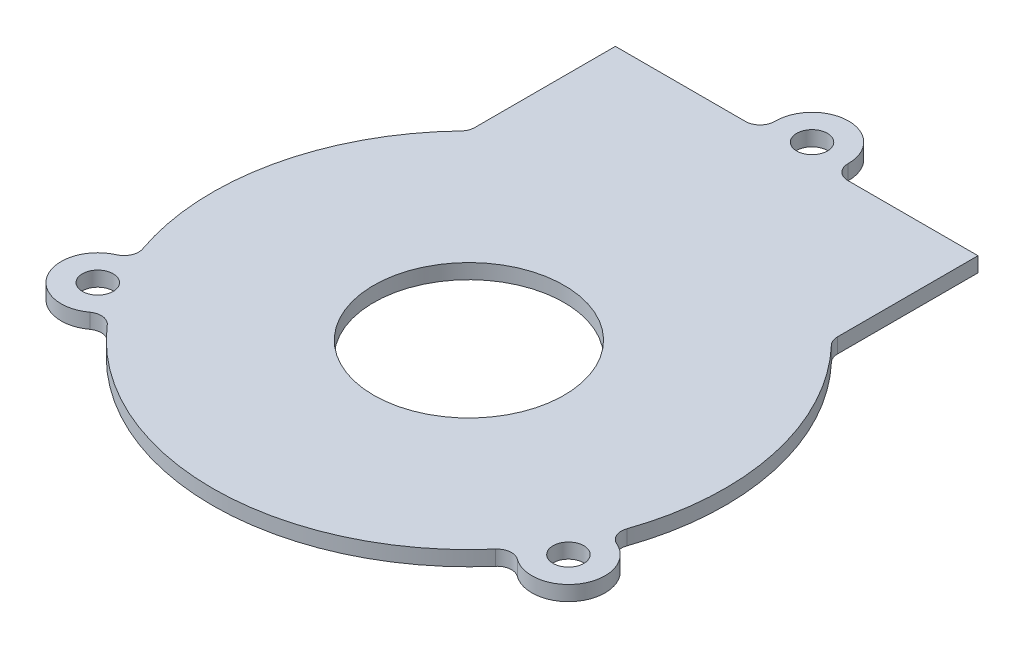
ISO-10303-21;
HEADER;
FILE_DESCRIPTION(('STEP AP214'),'2;1');
FILE_NAME('part.step','',(''),(''),'','','');
FILE_SCHEMA(('AUTOMOTIVE_DESIGN { 1 0 10303 214 1 1 1 1 }'));
ENDSEC;
DATA;
#1=APPLICATION_CONTEXT('core data for automotive mechanical design processes');
#2=APPLICATION_PROTOCOL_DEFINITION('international standard','automotive_design',2000,#1);
#3=PRODUCT_CONTEXT('',#1,'mechanical');
#4=PRODUCT('Part','Part','',(#3));
#5=PRODUCT_RELATED_PRODUCT_CATEGORY('part','',(#4));
#6=PRODUCT_DEFINITION_FORMATION('','',#4);
#7=PRODUCT_DEFINITION_CONTEXT('part definition',#1,'design');
#8=PRODUCT_DEFINITION('design','',#6,#7);
#9=PRODUCT_DEFINITION_SHAPE('','',#8);
#10=(LENGTH_UNIT() NAMED_UNIT(*) SI_UNIT(.MILLI.,.METRE.));
#11=(NAMED_UNIT(*) PLANE_ANGLE_UNIT() SI_UNIT($,.RADIAN.));
#12=(NAMED_UNIT(*) SI_UNIT($,.STERADIAN.) SOLID_ANGLE_UNIT());
#13=UNCERTAINTY_MEASURE_WITH_UNIT(LENGTH_MEASURE(1.E-05),#10,'distance_accuracy_value','');
#14=(GEOMETRIC_REPRESENTATION_CONTEXT(3) GLOBAL_UNCERTAINTY_ASSIGNED_CONTEXT((#13)) GLOBAL_UNIT_ASSIGNED_CONTEXT((#10,
#11,#12)) REPRESENTATION_CONTEXT('',''));
#15=CARTESIAN_POINT('',(0.,0.,0.));
#16=DIRECTION('',(0.,0.,1.));
#17=DIRECTION('',(1.,0.,0.));
#18=AXIS2_PLACEMENT_3D('',#15,#16,#17);
#19=CARTESIAN_POINT('',(0.,2.032,0.));
#20=DIRECTION('',(0.,-1.,0.));
#21=DIRECTION('',(0.,0.,-1.));
#22=AXIS2_PLACEMENT_3D('',#19,#20,#21);
#23=CYLINDRICAL_SURFACE('',#22,35.);
#24=CARTESIAN_POINT('',(0.,0.,0.));
#25=DIRECTION('',(0.,1.,0.));
#26=DIRECTION('',(0.,0.,1.));
#27=AXIS2_PLACEMENT_3D('',#24,#25,#26);
#28=CIRCLE('',#27,35.);
#29=CARTESIAN_POINT('',(-25.3019754085747,0.,-24.1828459951239));
#30=VERTEX_POINT('',#29);
#31=CARTESIAN_POINT('',(-33.072840065109,0.,11.4537002766671));
#32=VERTEX_POINT('',#31);
#33=EDGE_CURVE('E211',#30,#32,#28,.T.);
#34=ORIENTED_EDGE('',*,*,#33,.T.);
#35=DIRECTION('',(0.,-1.,0.));
#36=VECTOR('',#35,1.);
#37=CARTESIAN_POINT('',(-33.072840065109,2.032,11.4537002766671));
#38=LINE('',#37,#36);
#39=CARTESIAN_POINT('',(-33.072840065109,2.032,11.4537002766671));
#40=VERTEX_POINT('',#39);
#41=EDGE_CURVE('E224',#32,#40,#38,.F.);
#42=ORIENTED_EDGE('',*,*,#41,.T.);
#43=CARTESIAN_POINT('',(0.,2.032,0.));
#44=DIRECTION('',(0.,1.,0.));
#45=DIRECTION('',(0.,0.,1.));
#46=AXIS2_PLACEMENT_3D('',#43,#44,#45);
#47=CIRCLE('',#46,35.);
#48=CARTESIAN_POINT('',(-25.3019754085747,2.032,-24.1828459951239));
#49=VERTEX_POINT('',#48);
#50=EDGE_CURVE('E205',#49,#40,#47,.T.);
#51=ORIENTED_EDGE('',*,*,#50,.F.);
#52=DIRECTION('',(0.,-1.,0.));
#53=VECTOR('',#52,1.);
#54=CARTESIAN_POINT('',(-25.3019754085747,2.032,-24.1828459951239));
#55=LINE('',#54,#53);
#56=EDGE_CURVE('E218',#49,#30,#55,.T.);
#57=ORIENTED_EDGE('',*,*,#56,.T.);
#58=EDGE_LOOP('',(#34,#42,#51,#57));
#59=FACE_BOUND('',#58,.T.);
#60=ADVANCED_FACE('F43',(#59),#23,.T.);
#61=CARTESIAN_POINT('',(-26.5021889393046,0.,22.8611894140572));
#62=VERTEX_POINT('',#61);
#63=CARTESIAN_POINT('',(26.4887144081727,0.,22.8768006723464));
#64=VERTEX_POINT('',#63);
#65=EDGE_CURVE('E214',#62,#64,#28,.T.);
#66=ORIENTED_EDGE('',*,*,#65,.T.);
#67=DIRECTION('',(0.,-1.,0.));
#68=VECTOR('',#67,1.);
#69=CARTESIAN_POINT('',(26.4887144081727,2.032,22.8768006723464));
#70=LINE('',#69,#68);
#71=CARTESIAN_POINT('',(26.4887144081727,2.032,22.8768006723464));
#72=VERTEX_POINT('',#71);
#73=EDGE_CURVE('E243',#64,#72,#70,.F.);
#74=ORIENTED_EDGE('',*,*,#73,.T.);
#75=CARTESIAN_POINT('',(-26.5021889393046,2.032,22.8611894140572));
#76=VERTEX_POINT('',#75);
#77=EDGE_CURVE('E209',#76,#72,#47,.T.);
#78=ORIENTED_EDGE('',*,*,#77,.F.);
#79=DIRECTION('',(0.,-1.,0.));
#80=VECTOR('',#79,1.);
#81=CARTESIAN_POINT('',(-26.5021889393046,2.032,22.8611894140572));
#82=LINE('',#81,#80);
#83=EDGE_CURVE('E234',#76,#62,#82,.T.);
#84=ORIENTED_EDGE('',*,*,#83,.T.);
#85=EDGE_LOOP('',(#66,#74,#78,#84));
#86=FACE_BOUND('',#85,.T.);
#87=ADVANCED_FACE('F366',(#86),#23,.T.);
#88=CARTESIAN_POINT('',(-24.7478605121482,-53.381962685779,-44.7452325826062));
#89=DIRECTION('',(3.0206381024394E-06,0.,0.999999999995438));
#90=DIRECTION('',(0.999999999995438,0.,-3.0206381024394E-06));
#91=AXIS2_PLACEMENT_3D('',#88,#89,#90);
#92=PLANE('',#91);
#93=DIRECTION('',(0.999999999995438,0.,-3.0206381024394E-06));
#94=VECTOR('',#93,1.);
#95=CARTESIAN_POINT('',(-24.7478605121482,2.032,-44.7452325826062));
#96=LINE('',#95,#94);
#97=CARTESIAN_POINT('',(-24.7478605121482,2.032,-44.7452325826062));
#98=VERTEX_POINT('',#97);
#99=CARTESIAN_POINT('',(-6.99532394188785,2.032,-44.7452862065945));
#100=VERTEX_POINT('',#99);
#101=EDGE_CURVE('E177',#98,#100,#96,.T.);
#102=ORIENTED_EDGE('',*,*,#101,.T.);
#103=DIRECTION('',(0.,1.,0.));
#104=VECTOR('',#103,1.);
#105=CARTESIAN_POINT('',(-6.99532394188785,-53.381962685779,-44.7452862065945));
#106=LINE('',#105,#104);
#107=CARTESIAN_POINT('',(-6.99532394188785,0.,-44.7452862065945));
#108=VERTEX_POINT('',#107);
#109=EDGE_CURVE('E278',#100,#108,#106,.F.);
#110=ORIENTED_EDGE('',*,*,#109,.T.);
#111=DIRECTION('',(-0.999999999995438,0.,3.0206381024394E-06));
#112=VECTOR('',#111,1.);
#113=CARTESIAN_POINT('',(-24.7478605121482,0.,-44.7452325826062));
#114=LINE('',#113,#112);
#115=CARTESIAN_POINT('',(-24.7478605121482,0.,-44.7452325826062));
#116=VERTEX_POINT('',#115);
#117=EDGE_CURVE('E198',#108,#116,#114,.T.);
#118=ORIENTED_EDGE('',*,*,#117,.T.);
#119=DIRECTION('',(0.,1.,0.));
#120=VECTOR('',#119,1.);
#121=CARTESIAN_POINT('',(-24.7478605121482,-53.381962685779,-44.7452325826062));
#122=LINE('',#121,#120);
#123=EDGE_CURVE('E194',#116,#98,#122,.T.);
#124=ORIENTED_EDGE('',*,*,#123,.T.);
#125=EDGE_LOOP('',(#102,#110,#118,#124));
#126=FACE_BOUND('',#125,.T.);
#127=ADVANCED_FACE('F284',(#126),#92,.F.);
#128=CARTESIAN_POINT('',(33.0630730181294,0.,11.4818640733046));
#129=VERTEX_POINT('',#128);
#130=CARTESIAN_POINT('',(25.3018293128609,0.,-24.1829988509046));
#131=VERTEX_POINT('',#130);
#132=EDGE_CURVE('E215',#129,#131,#28,.T.);
#133=ORIENTED_EDGE('',*,*,#132,.T.);
#134=DIRECTION('',(0.,-1.,0.));
#135=VECTOR('',#134,1.);
#136=CARTESIAN_POINT('',(25.3018293128609,2.032,-24.1829988509046));
#137=LINE('',#136,#135);
#138=CARTESIAN_POINT('',(25.3018293128609,2.032,-24.1829988509046));
#139=VERTEX_POINT('',#138);
#140=EDGE_CURVE('E262',#131,#139,#137,.F.);
#141=ORIENTED_EDGE('',*,*,#140,.T.);
#142=CARTESIAN_POINT('',(33.0630730181294,2.032,11.4818640733046));
#143=VERTEX_POINT('',#142);
#144=EDGE_CURVE('E210',#143,#139,#47,.T.);
#145=ORIENTED_EDGE('',*,*,#144,.F.);
#146=DIRECTION('',(0.,-1.,0.));
#147=VECTOR('',#146,1.);
#148=CARTESIAN_POINT('',(33.0630730181294,2.032,11.4818640733046));
#149=LINE('',#148,#147);
#150=EDGE_CURVE('E253',#143,#129,#149,.T.);
#151=ORIENTED_EDGE('',*,*,#150,.T.);
#152=EDGE_LOOP('',(#133,#141,#145,#151));
#153=FACE_BOUND('',#152,.T.);
#154=ADVANCED_FACE('F343',(#153),#23,.T.);
#155=CARTESIAN_POINT('',(0.,2.032,0.));
#156=DIRECTION('',(0.,1.,0.));
#157=DIRECTION('',(0.,0.,1.));
#158=AXIS2_PLACEMENT_3D('',#155,#156,#157);
#159=PLANE('',#158);
#160=CARTESIAN_POINT('',(0.,2.032,0.));
#161=DIRECTION('',(0.,1.,0.));
#162=DIRECTION('',(0.,0.,1.));
#163=AXIS2_PLACEMENT_3D('',#160,#161,#162);
#164=CIRCLE('',#163,13.);
#165=CARTESIAN_POINT('',(0.,2.032,13.));
#166=VERTEX_POINT('',#165);
#167=EDGE_CURVE('E335',#166,#166,#164,.T.);
#168=ORIENTED_EDGE('',*,*,#167,.F.);
#169=EDGE_LOOP('',(#168));
#170=FACE_BOUND('',#169,.T.);
#171=CARTESIAN_POINT('',(-32.1480166138315,2.032,18.5087961651664));
#172=DIRECTION('',(0.,1.,0.));
#173=DIRECTION('',(0.,0.,1.));
#174=AXIS2_PLACEMENT_3D('',#171,#172,#173);
#175=CIRCLE('',#174,2.09999999999999);
#176=CARTESIAN_POINT('',(-32.1480166138315,2.032,20.6087961651664));
#177=VERTEX_POINT('',#176);
#178=EDGE_CURVE('E329',#177,#177,#175,.T.);
#179=ORIENTED_EDGE('',*,*,#178,.F.);
#180=EDGE_LOOP('',(#179));
#181=FACE_BOUND('',#180,.T.);
#182=DIRECTION('',(-3.02063810260161E-06,0.,-0.999999999995438));
#183=VECTOR('',#182,1.);
#184=CARTESIAN_POINT('',(-24.7478001128037,2.032,-24.7496745347634));
#185=LINE('',#184,#183);
#186=CARTESIAN_POINT('',(-24.7478025747881,2.032,-25.5647289504072));
#187=VERTEX_POINT('',#186);
#188=EDGE_CURVE('E195',#187,#98,#185,.T.);
#189=ORIENTED_EDGE('',*,*,#188,.F.);
#190=CARTESIAN_POINT('',(-26.747802574779,2.032,-25.564722909131));
#191=DIRECTION('',(0.,1.,0.));
#192=DIRECTION('',(0.,0.,1.));
#193=AXIS2_PLACEMENT_3D('',#190,#191,#192);
#194=CIRCLE('',#193,2.);
#195=EDGE_CURVE('E220',#187,#49,#194,.F.);
#196=ORIENTED_EDGE('',*,*,#195,.T.);
#197=ORIENTED_EDGE('',*,*,#50,.T.);
#198=CARTESIAN_POINT('',(-34.9627166402581,2.032,12.1081974353338));
#199=DIRECTION('',(0.,1.,0.));
#200=DIRECTION('',(0.,0.,1.));
#201=AXIS2_PLACEMENT_3D('',#198,#199,#200);
#202=CIRCLE('',#201,2.);
#203=CARTESIAN_POINT('',(-34.1580179965192,2.032,13.9391698799011));
#204=VERTEX_POINT('',#203);
#205=EDGE_CURVE('E230',#40,#204,#202,.F.);
#206=ORIENTED_EDGE('',*,*,#205,.T.);
#207=CARTESIAN_POINT('',(-32.1464555555357,2.032,18.5161819435163));
#208=DIRECTION('',(0.,1.,0.));
#209=DIRECTION('',(0.,0.,1.));
#210=AXIS2_PLACEMENT_3D('',#207,#208,#209);
#211=CIRCLE('',#210,4.99954226749351);
#212=CARTESIAN_POINT('',(-29.1966357044392,2.032,22.5527628891349));
#213=VERTEX_POINT('',#212);
#214=EDGE_CURVE('E323',#204,#213,#211,.T.);
#215=ORIENTED_EDGE('',*,*,#214,.T.);
#216=CARTESIAN_POINT('',(-28.0165997358363,2.032,24.1675430948605));
#217=DIRECTION('',(0.,1.,0.));
#218=DIRECTION('',(0.,0.,1.));
#219=AXIS2_PLACEMENT_3D('',#216,#217,#218);
#220=CIRCLE('',#219,2.);
#221=EDGE_CURVE('E241',#213,#76,#220,.F.);
#222=ORIENTED_EDGE('',*,*,#221,.T.);
#223=ORIENTED_EDGE('',*,*,#77,.T.);
#224=CARTESIAN_POINT('',(28.0023552314968,2.032,24.1840464250519));
#225=DIRECTION('',(0.,1.,0.));
#226=DIRECTION('',(0.,0.,1.));
#227=AXIS2_PLACEMENT_3D('',#224,#225,#226);
#228=CIRCLE('',#227,2.);
#229=CARTESIAN_POINT('',(29.184359284545,2.032,22.5707062815676));
#230=VERTEX_POINT('',#229);
#231=EDGE_CURVE('E249',#72,#230,#228,.F.);
#232=ORIENTED_EDGE('',*,*,#231,.T.);
#233=CARTESIAN_POINT('',(32.1364886347761,2.032,18.5412879583363));
#234=DIRECTION('',(0.,1.,0.));
#235=DIRECTION('',(0.,0.,1.));
#236=AXIS2_PLACEMENT_3D('',#233,#234,#235);
#237=CIRCLE('',#236,4.9951255964279);
#238=CARTESIAN_POINT('',(34.147287178261,2.032,13.9687647007018));
#239=VERTEX_POINT('',#238);
#240=EDGE_CURVE('E312',#230,#239,#237,.T.);
#241=ORIENTED_EDGE('',*,*,#240,.T.);
#242=CARTESIAN_POINT('',(34.9523914763083,2.032,12.1379705917791));
#243=DIRECTION('',(0.,1.,0.));
#244=DIRECTION('',(0.,0.,1.));
#245=AXIS2_PLACEMENT_3D('',#242,#243,#244);
#246=CIRCLE('',#245,2.);
#247=EDGE_CURVE('E260',#239,#143,#246,.F.);
#248=ORIENTED_EDGE('',*,*,#247,.T.);
#249=ORIENTED_EDGE('',*,*,#144,.T.);
#250=CARTESIAN_POINT('',(26.7476481307387,2.032,-25.5648844995277));
#251=DIRECTION('',(0.,1.,0.));
#252=DIRECTION('',(0.,0.,1.));
#253=AXIS2_PLACEMENT_3D('',#250,#251,#252);
#254=CIRCLE('',#253,2.);
#255=CARTESIAN_POINT('',(24.7476481307478,2.032,-25.5648784582515));
#256=VERTEX_POINT('',#255);
#257=EDGE_CURVE('E185',#139,#256,#254,.F.);
#258=ORIENTED_EDGE('',*,*,#257,.T.);
#259=DIRECTION('',(-3.02063810260161E-06,0.,-0.999999999995438));
#260=VECTOR('',#259,1.);
#261=CARTESIAN_POINT('',(24.7476505927322,2.032,-24.7498240426077));
#262=LINE('',#261,#260);
#263=CARTESIAN_POINT('',(24.7475901933877,2.032,-44.7453820904505));
#264=VERTEX_POINT('',#263);
#265=EDGE_CURVE('E178',#256,#264,#262,.T.);
#266=ORIENTED_EDGE('',*,*,#265,.T.);
#267=CARTESIAN_POINT('',(6.99533660471705,2.032,-44.7453284673169));
#268=VERTEX_POINT('',#267);
#269=EDGE_CURVE('E168',#268,#264,#96,.T.);
#270=ORIENTED_EDGE('',*,*,#269,.F.);
#271=CARTESIAN_POINT('',(6.99533056344084,2.032,-46.7453284673078));
#272=DIRECTION('',(0.,1.,0.));
#273=DIRECTION('',(0.,0.,1.));
#274=AXIS2_PLACEMENT_3D('',#271,#272,#273);
#275=CIRCLE('',#274,2.);
#276=CARTESIAN_POINT('',(4.99551899083441,2.032,-46.7727815922561));
#277=VERTEX_POINT('',#276);
#278=EDGE_CURVE('E274',#268,#277,#275,.F.);
#279=ORIENTED_EDGE('',*,*,#278,.T.);
#280=CARTESIAN_POINT('',(0.,2.032,-46.8413593567393));
#281=DIRECTION('',(0.,1.,0.));
#282=DIRECTION('',(0.,0.,1.));
#283=AXIS2_PLACEMENT_3D('',#280,#281,#282);
#284=CIRCLE('',#283,4.99598968149142);
#285=CARTESIAN_POINT('',(-4.99551857644603,2.032,-46.7727514129473));
#286=VERTEX_POINT('',#285);
#287=EDGE_CURVE('E304',#277,#286,#284,.T.);
#288=ORIENTED_EDGE('',*,*,#287,.T.);
#289=CARTESIAN_POINT('',(-6.99532998316405,2.032,-46.7452862065854));
#290=DIRECTION('',(0.,1.,0.));
#291=DIRECTION('',(0.,0.,1.));
#292=AXIS2_PLACEMENT_3D('',#289,#290,#291);
#293=CIRCLE('',#292,2.);
#294=EDGE_CURVE('E12',#286,#100,#293,.F.);
#295=ORIENTED_EDGE('',*,*,#294,.T.);
#296=ORIENTED_EDGE('',*,*,#101,.F.);
#297=EDGE_LOOP('',(#189,#196,#197,#206,#215,#222,#223,#232,#241,#248,#249,#258,#266,#270,#279,
#288,#295,#296));
#298=FACE_BOUND('',#297,.T.);
#299=CARTESIAN_POINT('',(32.1247811991366,2.032,18.5356173256723));
#300=DIRECTION('',(0.,1.,0.));
#301=DIRECTION('',(0.,0.,1.));
#302=AXIS2_PLACEMENT_3D('',#299,#300,#301);
#303=CIRCLE('',#302,2.1);
#304=CARTESIAN_POINT('',(32.1247811991366,2.032,20.6356173256723));
#305=VERTEX_POINT('',#304);
#306=EDGE_CURVE('E318',#305,#305,#303,.T.);
#307=ORIENTED_EDGE('',*,*,#306,.F.);
#308=EDGE_LOOP('',(#307));
#309=FACE_BOUND('',#308,.T.);
#310=CARTESIAN_POINT('',(0.,2.032,-46.8413593567393));
#311=DIRECTION('',(0.,1.,0.));
#312=DIRECTION('',(0.,0.,1.));
#313=AXIS2_PLACEMENT_3D('',#310,#311,#312);
#314=CIRCLE('',#313,2.09605202456873);
#315=CARTESIAN_POINT('',(0.,2.032,-44.7453073321706));
#316=VERTEX_POINT('',#315);
#317=EDGE_CURVE('E306',#316,#316,#314,.T.);
#318=ORIENTED_EDGE('',*,*,#317,.F.);
#319=EDGE_LOOP('',(#318));
#320=FACE_BOUND('',#319,.T.);
#321=ADVANCED_FACE('F182',(#170,#181,#298,#309,#320),#159,.T.);
#322=CARTESIAN_POINT('',(0.,0.,0.));
#323=DIRECTION('',(0.,1.,0.));
#324=DIRECTION('',(0.,0.,1.));
#325=AXIS2_PLACEMENT_3D('',#322,#323,#324);
#326=PLANE('',#325);
#327=CARTESIAN_POINT('',(0.,0.,0.));
#328=DIRECTION('',(0.,1.,0.));
#329=DIRECTION('',(0.,0.,1.));
#330=AXIS2_PLACEMENT_3D('',#327,#328,#329);
#331=CIRCLE('',#330,13.);
#332=CARTESIAN_POINT('',(0.,0.,13.));
#333=VERTEX_POINT('',#332);
#334=EDGE_CURVE('E332',#333,#333,#331,.F.);
#335=ORIENTED_EDGE('',*,*,#334,.F.);
#336=EDGE_LOOP('',(#335));
#337=FACE_BOUND('',#336,.T.);
#338=CARTESIAN_POINT('',(-32.1480166138315,0.,18.5087961651664));
#339=DIRECTION('',(0.,1.,0.));
#340=DIRECTION('',(0.,0.,1.));
#341=AXIS2_PLACEMENT_3D('',#338,#339,#340);
#342=CIRCLE('',#341,2.1);
#343=CARTESIAN_POINT('',(-32.1480166138315,0.,20.6087961651664));
#344=VERTEX_POINT('',#343);
#345=EDGE_CURVE('E326',#344,#344,#342,.T.);
#346=ORIENTED_EDGE('',*,*,#345,.T.);
#347=EDGE_LOOP('',(#346));
#348=FACE_BOUND('',#347,.T.);
#349=CARTESIAN_POINT('',(32.1247811991366,0.,18.5356173256723));
#350=DIRECTION('',(0.,1.,0.));
#351=DIRECTION('',(0.,0.,1.));
#352=AXIS2_PLACEMENT_3D('',#349,#350,#351);
#353=CIRCLE('',#352,2.1);
#354=CARTESIAN_POINT('',(32.1247811991366,0.,20.6356173256723));
#355=VERTEX_POINT('',#354);
#356=EDGE_CURVE('E315',#355,#355,#353,.T.);
#357=ORIENTED_EDGE('',*,*,#356,.T.);
#358=EDGE_LOOP('',(#357));
#359=FACE_BOUND('',#358,.T.);
#360=CARTESIAN_POINT('',(0.,0.,-46.8413593567393));
#361=DIRECTION('',(0.,1.,0.));
#362=DIRECTION('',(0.,0.,1.));
#363=AXIS2_PLACEMENT_3D('',#360,#361,#362);
#364=CIRCLE('',#363,2.09605202456873);
#365=CARTESIAN_POINT('',(0.,0.,-44.7453073321706));
#366=VERTEX_POINT('',#365);
#367=EDGE_CURVE('E188',#366,#366,#364,.F.);
#368=ORIENTED_EDGE('',*,*,#367,.F.);
#369=EDGE_LOOP('',(#368));
#370=FACE_BOUND('',#369,.T.);
#371=ORIENTED_EDGE('',*,*,#65,.F.);
#372=CARTESIAN_POINT('',(-28.0165997358363,0.,24.1675430948605));
#373=DIRECTION('',(0.,1.,0.));
#374=DIRECTION('',(0.,0.,1.));
#375=AXIS2_PLACEMENT_3D('',#372,#373,#374);
#376=CIRCLE('',#375,2.);
#377=CARTESIAN_POINT('',(-29.1966357044392,0.,22.5527628891349));
#378=VERTEX_POINT('',#377);
#379=EDGE_CURVE('E239',#62,#378,#376,.T.);
#380=ORIENTED_EDGE('',*,*,#379,.T.);
#381=CARTESIAN_POINT('',(-32.1464555555357,0.,18.5161819435163));
#382=DIRECTION('',(0.,1.,0.));
#383=DIRECTION('',(0.,0.,1.));
#384=AXIS2_PLACEMENT_3D('',#381,#382,#383);
#385=CIRCLE('',#384,4.99954226749351);
#386=CARTESIAN_POINT('',(-34.1580179965192,0.,13.9391698799011));
#387=VERTEX_POINT('',#386);
#388=EDGE_CURVE('E321',#378,#387,#385,.F.);
#389=ORIENTED_EDGE('',*,*,#388,.T.);
#390=CARTESIAN_POINT('',(-34.9627166402581,0.,12.1081974353338));
#391=DIRECTION('',(0.,1.,0.));
#392=DIRECTION('',(0.,0.,1.));
#393=AXIS2_PLACEMENT_3D('',#390,#391,#392);
#394=CIRCLE('',#393,2.);
#395=EDGE_CURVE('E232',#387,#32,#394,.T.);
#396=ORIENTED_EDGE('',*,*,#395,.T.);
#397=ORIENTED_EDGE('',*,*,#33,.F.);
#398=CARTESIAN_POINT('',(-26.747802574779,0.,-25.564722909131));
#399=DIRECTION('',(0.,1.,0.));
#400=DIRECTION('',(0.,0.,1.));
#401=AXIS2_PLACEMENT_3D('',#398,#399,#400);
#402=CIRCLE('',#401,2.);
#403=CARTESIAN_POINT('',(-24.7478025747881,0.,-25.5647289504072));
#404=VERTEX_POINT('',#403);
#405=EDGE_CURVE('E222',#30,#404,#402,.T.);
#406=ORIENTED_EDGE('',*,*,#405,.T.);
#407=DIRECTION('',(3.02063810260161E-06,0.,0.999999999995438));
#408=VECTOR('',#407,1.);
#409=CARTESIAN_POINT('',(-24.7478001128037,0.,-24.7496745347634));
#410=LINE('',#409,#408);
#411=EDGE_CURVE('E204',#116,#404,#410,.T.);
#412=ORIENTED_EDGE('',*,*,#411,.F.);
#413=ORIENTED_EDGE('',*,*,#117,.F.);
#414=CARTESIAN_POINT('',(-6.99532998316405,0.,-46.7452862065854));
#415=DIRECTION('',(0.,1.,0.));
#416=DIRECTION('',(0.,0.,1.));
#417=AXIS2_PLACEMENT_3D('',#414,#415,#416);
#418=CIRCLE('',#417,2.);
#419=CARTESIAN_POINT('',(-4.99551857644603,0.,-46.7727514129473));
#420=VERTEX_POINT('',#419);
#421=EDGE_CURVE('E51',#108,#420,#418,.T.);
#422=ORIENTED_EDGE('',*,*,#421,.T.);
#423=CARTESIAN_POINT('',(0.,0.,-46.8413593567393));
#424=DIRECTION('',(0.,1.,0.));
#425=DIRECTION('',(0.,0.,1.));
#426=AXIS2_PLACEMENT_3D('',#423,#424,#425);
#427=CIRCLE('',#426,4.99598968149142);
#428=CARTESIAN_POINT('',(4.99551899083441,0.,-46.7727815922561));
#429=VERTEX_POINT('',#428);
#430=EDGE_CURVE('E303',#420,#429,#427,.F.);
#431=ORIENTED_EDGE('',*,*,#430,.T.);
#432=CARTESIAN_POINT('',(6.99533056344084,0.,-46.7453284673078));
#433=DIRECTION('',(0.,1.,0.));
#434=DIRECTION('',(0.,0.,1.));
#435=AXIS2_PLACEMENT_3D('',#432,#433,#434);
#436=CIRCLE('',#435,2.);
#437=CARTESIAN_POINT('',(6.99533660471705,0.,-44.7453284673169));
#438=VERTEX_POINT('',#437);
#439=EDGE_CURVE('E276',#429,#438,#436,.T.);
#440=ORIENTED_EDGE('',*,*,#439,.T.);
#441=CARTESIAN_POINT('',(24.7475901933877,0.,-44.7453820904505));
#442=VERTEX_POINT('',#441);
#443=EDGE_CURVE('E202',#442,#438,#114,.T.);
#444=ORIENTED_EDGE('',*,*,#443,.F.);
#445=DIRECTION('',(3.02063810260161E-06,0.,0.999999999995438));
#446=VECTOR('',#445,1.);
#447=CARTESIAN_POINT('',(24.7476505927322,0.,-24.7498240426077));
#448=LINE('',#447,#446);
#449=CARTESIAN_POINT('',(24.7476481307478,0.,-25.5648784582515));
#450=VERTEX_POINT('',#449);
#451=EDGE_CURVE('E193',#442,#450,#448,.T.);
#452=ORIENTED_EDGE('',*,*,#451,.T.);
#453=CARTESIAN_POINT('',(26.7476481307387,0.,-25.5648844995277));
#454=DIRECTION('',(0.,1.,0.));
#455=DIRECTION('',(0.,0.,1.));
#456=AXIS2_PLACEMENT_3D('',#453,#454,#455);
#457=CIRCLE('',#456,2.);
#458=EDGE_CURVE('E268',#450,#131,#457,.T.);
#459=ORIENTED_EDGE('',*,*,#458,.T.);
#460=ORIENTED_EDGE('',*,*,#132,.F.);
#461=CARTESIAN_POINT('',(34.9523914763083,0.,12.1379705917791));
#462=DIRECTION('',(0.,1.,0.));
#463=DIRECTION('',(0.,0.,1.));
#464=AXIS2_PLACEMENT_3D('',#461,#462,#463);
#465=CIRCLE('',#464,2.);
#466=CARTESIAN_POINT('',(34.147287178261,0.,13.9687647007018));
#467=VERTEX_POINT('',#466);
#468=EDGE_CURVE('E258',#129,#467,#465,.T.);
#469=ORIENTED_EDGE('',*,*,#468,.T.);
#470=CARTESIAN_POINT('',(32.1364886347761,0.,18.5412879583363));
#471=DIRECTION('',(0.,1.,0.));
#472=DIRECTION('',(0.,0.,1.));
#473=AXIS2_PLACEMENT_3D('',#470,#471,#472);
#474=CIRCLE('',#473,4.9951255964279);
#475=CARTESIAN_POINT('',(29.184359284545,0.,22.5707062815676));
#476=VERTEX_POINT('',#475);
#477=EDGE_CURVE('E309',#467,#476,#474,.F.);
#478=ORIENTED_EDGE('',*,*,#477,.T.);
#479=CARTESIAN_POINT('',(28.0023552314968,0.,24.1840464250519));
#480=DIRECTION('',(0.,1.,0.));
#481=DIRECTION('',(0.,0.,1.));
#482=AXIS2_PLACEMENT_3D('',#479,#480,#481);
#483=CIRCLE('',#482,2.);
#484=EDGE_CURVE('E251',#476,#64,#483,.T.);
#485=ORIENTED_EDGE('',*,*,#484,.T.);
#486=EDGE_LOOP('',(#371,#380,#389,#396,#397,#406,#412,#413,#422,#431,#440,#444,#452,#459,#460,
#469,#478,#485));
#487=FACE_BOUND('',#486,.T.);
#488=ADVANCED_FACE('F290',(#337,#348,#359,#370,#487),#326,.F.);
#489=ORIENTED_EDGE('',*,*,#443,.T.);
#490=DIRECTION('',(0.,1.,0.));
#491=VECTOR('',#490,1.);
#492=CARTESIAN_POINT('',(6.99533660471705,-53.381962685779,-44.7453284673169));
#493=LINE('',#492,#491);
#494=EDGE_CURVE('E175',#438,#268,#493,.T.);
#495=ORIENTED_EDGE('',*,*,#494,.T.);
#496=ORIENTED_EDGE('',*,*,#269,.T.);
#497=DIRECTION('',(0.,1.,0.));
#498=VECTOR('',#497,1.);
#499=CARTESIAN_POINT('',(24.7475901933877,-53.381962685779,-44.7453820904505));
#500=LINE('',#499,#498);
#501=EDGE_CURVE('E173',#442,#264,#500,.T.);
#502=ORIENTED_EDGE('',*,*,#501,.F.);
#503=EDGE_LOOP('',(#489,#495,#496,#502));
#504=FACE_BOUND('',#503,.T.);
#505=ADVANCED_FACE('F171',(#504),#92,.F.);
#506=CARTESIAN_POINT('',(-24.7478001128037,-53.381962685779,-24.7496745347634));
#507=DIRECTION('',(0.999999999995438,0.,-3.02063810260161E-06));
#508=DIRECTION('',(-3.02063810260161E-06,0.,-0.999999999995438));
#509=AXIS2_PLACEMENT_3D('',#506,#507,#508);
#510=PLANE('',#509);
#511=ORIENTED_EDGE('',*,*,#411,.T.);
#512=DIRECTION('',(0.,1.,0.));
#513=VECTOR('',#512,1.);
#514=CARTESIAN_POINT('',(-24.7478025747881,2.032,-25.5647289504072));
#515=LINE('',#514,#513);
#516=EDGE_CURVE('E208',#404,#187,#515,.T.);
#517=ORIENTED_EDGE('',*,*,#516,.T.);
#518=ORIENTED_EDGE('',*,*,#188,.T.);
#519=ORIENTED_EDGE('',*,*,#123,.F.);
#520=EDGE_LOOP('',(#511,#517,#518,#519));
#521=FACE_BOUND('',#520,.T.);
#522=ADVANCED_FACE('F298',(#521),#510,.F.);
#523=CARTESIAN_POINT('',(24.7476505927322,-53.381962685779,-24.7498240426077));
#524=DIRECTION('',(0.999999999995438,0.,-3.02063810260161E-06));
#525=DIRECTION('',(-3.02063810260161E-06,0.,-0.999999999995438));
#526=AXIS2_PLACEMENT_3D('',#523,#524,#525);
#527=PLANE('',#526);
#528=ORIENTED_EDGE('',*,*,#265,.F.);
#529=DIRECTION('',(0.,-1.,0.));
#530=VECTOR('',#529,1.);
#531=CARTESIAN_POINT('',(24.7476481307478,-53.381962685779,-25.5648784582515));
#532=LINE('',#531,#530);
#533=EDGE_CURVE('E265',#256,#450,#532,.T.);
#534=ORIENTED_EDGE('',*,*,#533,.T.);
#535=ORIENTED_EDGE('',*,*,#451,.F.);
#536=ORIENTED_EDGE('',*,*,#501,.T.);
#537=EDGE_LOOP('',(#528,#534,#535,#536));
#538=FACE_BOUND('',#537,.T.);
#539=ADVANCED_FACE('F191',(#538),#527,.T.);
#540=CARTESIAN_POINT('',(0.,-14.1307927300824,-46.8413593567393));
#541=DIRECTION('',(0.,1.,0.));
#542=DIRECTION('',(0.,0.,1.));
#543=AXIS2_PLACEMENT_3D('',#540,#541,#542);
#544=CYLINDRICAL_SURFACE('',#543,4.99598968149142);
#545=ORIENTED_EDGE('',*,*,#430,.F.);
#546=DIRECTION('',(0.,1.,0.));
#547=VECTOR('',#546,1.);
#548=CARTESIAN_POINT('',(-4.99551857644604,-14.1307927300824,-46.7727514129473));
#549=LINE('',#548,#547);
#550=EDGE_CURVE('E64',#420,#286,#549,.T.);
#551=ORIENTED_EDGE('',*,*,#550,.T.);
#552=ORIENTED_EDGE('',*,*,#287,.F.);
#553=DIRECTION('',(0.,1.,0.));
#554=VECTOR('',#553,1.);
#555=CARTESIAN_POINT('',(4.99551899083441,-14.1307927300824,-46.7727815922561));
#556=LINE('',#555,#554);
#557=EDGE_CURVE('E271',#277,#429,#556,.F.);
#558=ORIENTED_EDGE('',*,*,#557,.T.);
#559=EDGE_LOOP('',(#545,#551,#552,#558));
#560=FACE_BOUND('',#559,.T.);
#561=ADVANCED_FACE('F392',(#560),#544,.T.);
#562=CARTESIAN_POINT('',(0.,-14.1307927300824,-46.8413593567393));
#563=DIRECTION('',(0.,1.,0.));
#564=DIRECTION('',(0.,0.,1.));
#565=AXIS2_PLACEMENT_3D('',#562,#563,#564);
#566=CYLINDRICAL_SURFACE('',#565,2.09605202456873);
#567=ORIENTED_EDGE('',*,*,#317,.T.);
#568=EDGE_LOOP('',(#567));
#569=FACE_BOUND('',#568,.T.);
#570=ORIENTED_EDGE('',*,*,#367,.T.);
#571=EDGE_LOOP('',(#570));
#572=FACE_BOUND('',#571,.T.);
#573=ADVANCED_FACE('F443',(#569,#572),#566,.F.);
#574=CARTESIAN_POINT('',(32.1364886347761,-14.1283487284507,18.5412879583363));
#575=DIRECTION('',(0.,1.,0.));
#576=DIRECTION('',(0.,0.,1.));
#577=AXIS2_PLACEMENT_3D('',#574,#575,#576);
#578=CYLINDRICAL_SURFACE('',#577,4.9951255964279);
#579=ORIENTED_EDGE('',*,*,#477,.F.);
#580=DIRECTION('',(0.,1.,0.));
#581=VECTOR('',#580,1.);
#582=CARTESIAN_POINT('',(34.147287178261,-14.1283487284507,13.9687647007018));
#583=LINE('',#582,#581);
#584=EDGE_CURVE('E256',#467,#239,#583,.T.);
#585=ORIENTED_EDGE('',*,*,#584,.T.);
#586=ORIENTED_EDGE('',*,*,#240,.F.);
#587=DIRECTION('',(0.,1.,0.));
#588=VECTOR('',#587,1.);
#589=CARTESIAN_POINT('',(29.184359284545,-14.1283487284507,22.5707062815676));
#590=LINE('',#589,#588);
#591=EDGE_CURVE('E246',#230,#476,#590,.F.);
#592=ORIENTED_EDGE('',*,*,#591,.T.);
#593=EDGE_LOOP('',(#579,#585,#586,#592));
#594=FACE_BOUND('',#593,.T.);
#595=ADVANCED_FACE('F438',(#594),#578,.T.);
#596=CARTESIAN_POINT('',(32.1247811991366,2.032,18.5356173256723));
#597=DIRECTION('',(0.,1.,0.));
#598=DIRECTION('',(0.,0.,1.));
#599=AXIS2_PLACEMENT_3D('',#596,#597,#598);
#600=CYLINDRICAL_SURFACE('',#599,2.1);
#601=ORIENTED_EDGE('',*,*,#356,.F.);
#602=EDGE_LOOP('',(#601));
#603=FACE_BOUND('',#602,.T.);
#604=ORIENTED_EDGE('',*,*,#306,.T.);
#605=EDGE_LOOP('',(#604));
#606=FACE_BOUND('',#605,.T.);
#607=ADVANCED_FACE('F360',(#603,#606),#600,.F.);
#608=CARTESIAN_POINT('',(-32.1464555555357,-14.1408409606937,18.5161819435163));
#609=DIRECTION('',(0.,1.,0.));
#610=DIRECTION('',(0.,0.,1.));
#611=AXIS2_PLACEMENT_3D('',#608,#609,#610);
#612=CYLINDRICAL_SURFACE('',#611,4.99954226749351);
#613=ORIENTED_EDGE('',*,*,#388,.F.);
#614=DIRECTION('',(0.,1.,0.));
#615=VECTOR('',#614,1.);
#616=CARTESIAN_POINT('',(-29.1966357044392,-14.1408409606937,22.5527628891349));
#617=LINE('',#616,#615);
#618=EDGE_CURVE('E237',#378,#213,#617,.T.);
#619=ORIENTED_EDGE('',*,*,#618,.T.);
#620=ORIENTED_EDGE('',*,*,#214,.F.);
#621=DIRECTION('',(0.,1.,0.));
#622=VECTOR('',#621,1.);
#623=CARTESIAN_POINT('',(-34.1580179965192,-14.1408409606937,13.9391698799011));
#624=LINE('',#623,#622);
#625=EDGE_CURVE('E227',#204,#387,#624,.F.);
#626=ORIENTED_EDGE('',*,*,#625,.T.);
#627=EDGE_LOOP('',(#613,#619,#620,#626));
#628=FACE_BOUND('',#627,.T.);
#629=ADVANCED_FACE('F350',(#628),#612,.T.);
#630=CARTESIAN_POINT('',(-32.1480166138315,2.032,18.5087961651664));
#631=DIRECTION('',(0.,1.,0.));
#632=DIRECTION('',(0.,0.,1.));
#633=AXIS2_PLACEMENT_3D('',#630,#631,#632);
#634=CYLINDRICAL_SURFACE('',#633,2.09999999999999);
#635=ORIENTED_EDGE('',*,*,#345,.F.);
#636=EDGE_LOOP('',(#635));
#637=FACE_BOUND('',#636,.T.);
#638=ORIENTED_EDGE('',*,*,#178,.T.);
#639=EDGE_LOOP('',(#638));
#640=FACE_BOUND('',#639,.T.);
#641=ADVANCED_FACE('F347',(#637,#640),#634,.F.);
#642=CARTESIAN_POINT('',(-26.747802574779,2.032,-25.564722909131));
#643=DIRECTION('',(0.,-1.,0.));
#644=DIRECTION('',(0.,0.,-1.));
#645=AXIS2_PLACEMENT_3D('',#642,#643,#644);
#646=CYLINDRICAL_SURFACE('',#645,2.);
#647=ORIENTED_EDGE('',*,*,#405,.F.);
#648=ORIENTED_EDGE('',*,*,#56,.F.);
#649=ORIENTED_EDGE('',*,*,#195,.F.);
#650=ORIENTED_EDGE('',*,*,#516,.F.);
#651=EDGE_LOOP('',(#647,#648,#649,#650));
#652=FACE_BOUND('',#651,.T.);
#653=ADVANCED_FACE('F349',(#652),#646,.F.);
#654=CARTESIAN_POINT('',(-34.9627166402581,-14.1408409606937,12.1081974353338));
#655=DIRECTION('',(0.,-1.,0.));
#656=DIRECTION('',(0.,0.,-1.));
#657=AXIS2_PLACEMENT_3D('',#654,#655,#656);
#658=CYLINDRICAL_SURFACE('',#657,2.);
#659=ORIENTED_EDGE('',*,*,#395,.F.);
#660=ORIENTED_EDGE('',*,*,#625,.F.);
#661=ORIENTED_EDGE('',*,*,#205,.F.);
#662=ORIENTED_EDGE('',*,*,#41,.F.);
#663=EDGE_LOOP('',(#659,#660,#661,#662));
#664=FACE_BOUND('',#663,.T.);
#665=ADVANCED_FACE('F357',(#664),#658,.F.);
#666=CARTESIAN_POINT('',(-28.0165997358363,-14.1408409606937,24.1675430948605));
#667=DIRECTION('',(0.,1.,0.));
#668=DIRECTION('',(0.,0.,1.));
#669=AXIS2_PLACEMENT_3D('',#666,#667,#668);
#670=CYLINDRICAL_SURFACE('',#669,2.);
#671=ORIENTED_EDGE('',*,*,#221,.F.);
#672=ORIENTED_EDGE('',*,*,#618,.F.);
#673=ORIENTED_EDGE('',*,*,#379,.F.);
#674=ORIENTED_EDGE('',*,*,#83,.F.);
#675=EDGE_LOOP('',(#671,#672,#673,#674));
#676=FACE_BOUND('',#675,.T.);
#677=ADVANCED_FACE('F411',(#676),#670,.F.);
#678=CARTESIAN_POINT('',(28.0023552314968,-14.1283487284507,24.1840464250519));
#679=DIRECTION('',(0.,-1.,0.));
#680=DIRECTION('',(0.,0.,-1.));
#681=AXIS2_PLACEMENT_3D('',#678,#679,#680);
#682=CYLINDRICAL_SURFACE('',#681,2.);
#683=ORIENTED_EDGE('',*,*,#484,.F.);
#684=ORIENTED_EDGE('',*,*,#591,.F.);
#685=ORIENTED_EDGE('',*,*,#231,.F.);
#686=ORIENTED_EDGE('',*,*,#73,.F.);
#687=EDGE_LOOP('',(#683,#684,#685,#686));
#688=FACE_BOUND('',#687,.T.);
#689=ADVANCED_FACE('F407',(#688),#682,.F.);
#690=CARTESIAN_POINT('',(34.9523914763083,-14.1283487284507,12.1379705917791));
#691=DIRECTION('',(0.,1.,0.));
#692=DIRECTION('',(0.,0.,1.));
#693=AXIS2_PLACEMENT_3D('',#690,#691,#692);
#694=CYLINDRICAL_SURFACE('',#693,2.);
#695=ORIENTED_EDGE('',*,*,#247,.F.);
#696=ORIENTED_EDGE('',*,*,#584,.F.);
#697=ORIENTED_EDGE('',*,*,#468,.F.);
#698=ORIENTED_EDGE('',*,*,#150,.F.);
#699=EDGE_LOOP('',(#695,#696,#697,#698));
#700=FACE_BOUND('',#699,.T.);
#701=ADVANCED_FACE('F402',(#700),#694,.F.);
#702=CARTESIAN_POINT('',(26.7476481307387,2.032,-25.5648844995277));
#703=DIRECTION('',(0.,-1.,0.));
#704=DIRECTION('',(0.,0.,-1.));
#705=AXIS2_PLACEMENT_3D('',#702,#703,#704);
#706=CYLINDRICAL_SURFACE('',#705,2.);
#707=ORIENTED_EDGE('',*,*,#458,.F.);
#708=ORIENTED_EDGE('',*,*,#533,.F.);
#709=ORIENTED_EDGE('',*,*,#257,.F.);
#710=ORIENTED_EDGE('',*,*,#140,.F.);
#711=EDGE_LOOP('',(#707,#708,#709,#710));
#712=FACE_BOUND('',#711,.T.);
#713=ADVANCED_FACE('F387',(#712),#706,.F.);
#714=CARTESIAN_POINT('',(6.99533056344084,-14.1307927300824,-46.7453284673078));
#715=DIRECTION('',(0.,1.,0.));
#716=DIRECTION('',(0.,0.,1.));
#717=AXIS2_PLACEMENT_3D('',#714,#715,#716);
#718=CYLINDRICAL_SURFACE('',#717,2.);
#719=ORIENTED_EDGE('',*,*,#439,.F.);
#720=ORIENTED_EDGE('',*,*,#557,.F.);
#721=ORIENTED_EDGE('',*,*,#278,.F.);
#722=ORIENTED_EDGE('',*,*,#494,.F.);
#723=EDGE_LOOP('',(#719,#720,#721,#722));
#724=FACE_BOUND('',#723,.T.);
#725=ADVANCED_FACE('F390',(#724),#718,.F.);
#726=CARTESIAN_POINT('',(-6.99532998316405,-14.1307927300824,-46.7452862065854));
#727=DIRECTION('',(0.,1.,0.));
#728=DIRECTION('',(0.,0.,1.));
#729=AXIS2_PLACEMENT_3D('',#726,#727,#728);
#730=CYLINDRICAL_SURFACE('',#729,2.);
#731=ORIENTED_EDGE('',*,*,#294,.F.);
#732=ORIENTED_EDGE('',*,*,#550,.F.);
#733=ORIENTED_EDGE('',*,*,#421,.F.);
#734=ORIENTED_EDGE('',*,*,#109,.F.);
#735=EDGE_LOOP('',(#731,#732,#733,#734));
#736=FACE_BOUND('',#735,.T.);
#737=ADVANCED_FACE('F45',(#736),#730,.F.);
#738=CARTESIAN_POINT('',(0.,-36.7695526217005,0.));
#739=DIRECTION('',(0.,1.,0.));
#740=DIRECTION('',(0.,0.,1.));
#741=AXIS2_PLACEMENT_3D('',#738,#739,#740);
#742=CYLINDRICAL_SURFACE('',#741,13.);
#743=ORIENTED_EDGE('',*,*,#334,.T.);
#744=EDGE_LOOP('',(#743));
#745=FACE_BOUND('',#744,.T.);
#746=ORIENTED_EDGE('',*,*,#167,.T.);
#747=EDGE_LOOP('',(#746));
#748=FACE_BOUND('',#747,.T.);
#749=ADVANCED_FACE('F339',(#745,#748),#742,.F.);
#750=CLOSED_SHELL('',(#60,#87,#127,#154,#321,#488,#505,#522,#539,#561,#573,#595,#607,#629,#641,
#653,#665,#677,#689,#701,#713,#725,#737,#749));
#751=MANIFOLD_SOLID_BREP('B2',#750);
#752=ADVANCED_BREP_SHAPE_REPRESENTATION('',(#18,#751),#14);
#753=SHAPE_DEFINITION_REPRESENTATION(#9,#752);
ENDSEC;
END-ISO-10303-21;
